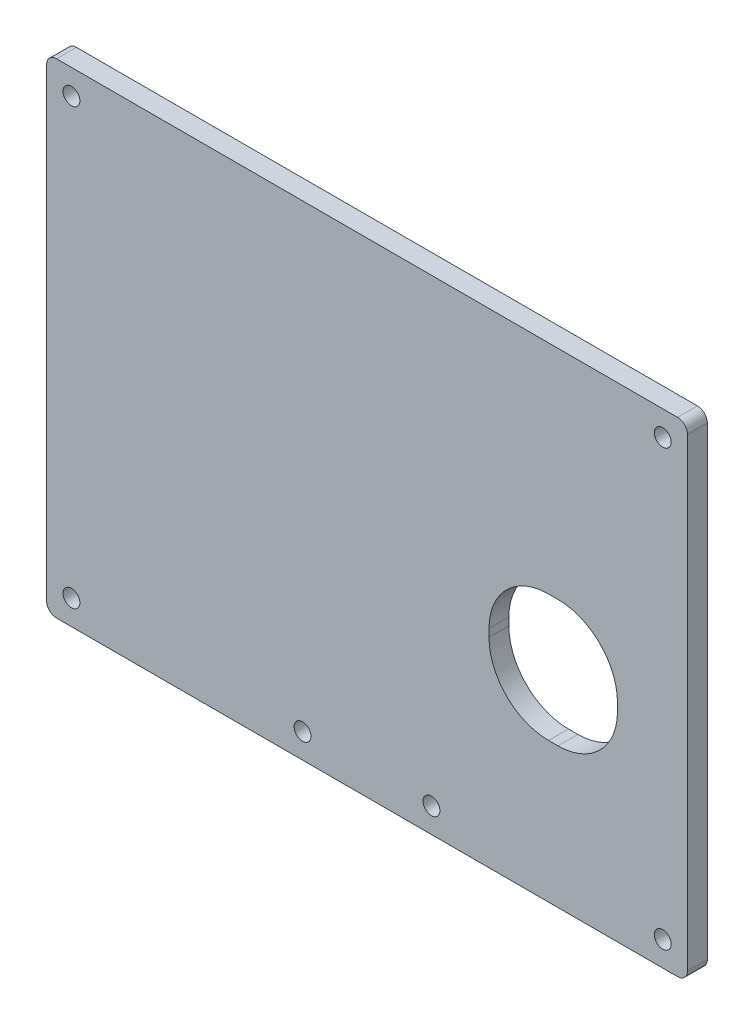
ISO-10303-21;
HEADER;
FILE_DESCRIPTION(('STEP AP214'),'2;1');
FILE_NAME('part.step','',(''),(''),'','','');
FILE_SCHEMA(('AUTOMOTIVE_DESIGN { 1 0 10303 214 1 1 1 1 }'));
ENDSEC;
DATA;
#1=APPLICATION_CONTEXT('core data for automotive mechanical design processes');
#2=APPLICATION_PROTOCOL_DEFINITION('international standard','automotive_design',2000,#1);
#3=PRODUCT_CONTEXT('',#1,'mechanical');
#4=PRODUCT('Part','Part','',(#3));
#5=PRODUCT_RELATED_PRODUCT_CATEGORY('part','',(#4));
#6=PRODUCT_DEFINITION_FORMATION('','',#4);
#7=PRODUCT_DEFINITION_CONTEXT('part definition',#1,'design');
#8=PRODUCT_DEFINITION('design','',#6,#7);
#9=PRODUCT_DEFINITION_SHAPE('','',#8);
#10=(LENGTH_UNIT() NAMED_UNIT(*) SI_UNIT(.MILLI.,.METRE.));
#11=(NAMED_UNIT(*) PLANE_ANGLE_UNIT() SI_UNIT($,.RADIAN.));
#12=(NAMED_UNIT(*) SI_UNIT($,.STERADIAN.) SOLID_ANGLE_UNIT());
#13=UNCERTAINTY_MEASURE_WITH_UNIT(LENGTH_MEASURE(1.E-05),#10,'distance_accuracy_value','');
#14=(GEOMETRIC_REPRESENTATION_CONTEXT(3) GLOBAL_UNCERTAINTY_ASSIGNED_CONTEXT((#13)) GLOBAL_UNIT_ASSIGNED_CONTEXT((#10,
#11,#12)) REPRESENTATION_CONTEXT('',''));
#15=CARTESIAN_POINT('',(0.,0.,0.));
#16=DIRECTION('',(0.,0.,1.));
#17=DIRECTION('',(1.,0.,0.));
#18=AXIS2_PLACEMENT_3D('',#15,#16,#17);
#19=CARTESIAN_POINT('',(6.58563613066051,33.7875307671692,4.));
#20=DIRECTION('',(0.,0.,-1.));
#21=DIRECTION('',(-1.,0.,0.));
#22=AXIS2_PLACEMENT_3D('',#19,#20,#21);
#23=CYLINDRICAL_SURFACE('',#22,2.);
#24=CARTESIAN_POINT('',(6.58563613066051,33.7875307671692,0.));
#25=DIRECTION('',(0.,0.,1.));
#26=DIRECTION('',(1.,0.,0.));
#27=AXIS2_PLACEMENT_3D('',#24,#25,#26);
#28=CIRCLE('',#27,2.);
#29=CARTESIAN_POINT('',(6.5856361306605,31.7875307671692,0.));
#30=VERTEX_POINT('',#29);
#31=CARTESIAN_POINT('',(8.58563613066051,33.7875307671692,0.));
#32=VERTEX_POINT('',#31);
#33=EDGE_CURVE('E172',#30,#32,#28,.T.);
#34=ORIENTED_EDGE('',*,*,#33,.T.);
#35=DIRECTION('',(0.,0.,-1.));
#36=VECTOR('',#35,1.);
#37=CARTESIAN_POINT('',(8.58563613066051,33.7875307671692,4.));
#38=LINE('',#37,#36);
#39=CARTESIAN_POINT('',(8.58563613066051,33.7875307671692,4.));
#40=VERTEX_POINT('',#39);
#41=EDGE_CURVE('E153',#40,#32,#38,.T.);
#42=ORIENTED_EDGE('',*,*,#41,.F.);
#43=CARTESIAN_POINT('',(6.58563613066051,33.7875307671692,4.));
#44=DIRECTION('',(0.,0.,1.));
#45=DIRECTION('',(1.,0.,0.));
#46=AXIS2_PLACEMENT_3D('',#43,#44,#45);
#47=CIRCLE('',#46,2.);
#48=CARTESIAN_POINT('',(6.5856361306605,31.7875307671692,4.));
#49=VERTEX_POINT('',#48);
#50=EDGE_CURVE('E160',#49,#40,#47,.T.);
#51=ORIENTED_EDGE('',*,*,#50,.F.);
#52=DIRECTION('',(0.,0.,-1.));
#53=VECTOR('',#52,1.);
#54=CARTESIAN_POINT('',(6.5856361306605,31.7875307671692,4.));
#55=LINE('',#54,#53);
#56=EDGE_CURVE('E266',#49,#30,#55,.T.);
#57=ORIENTED_EDGE('',*,*,#56,.T.);
#58=EDGE_LOOP('',(#34,#42,#51,#57));
#59=FACE_BOUND('',#58,.T.);
#60=ADVANCED_FACE('F35',(#59),#23,.T.);
#61=CARTESIAN_POINT('',(8.58563613066051,33.7875307671692,4.));
#62=DIRECTION('',(-1.,0.,0.));
#63=DIRECTION('',(0.,0.,1.));
#64=AXIS2_PLACEMENT_3D('',#61,#62,#63);
#65=PLANE('',#64);
#66=DIRECTION('',(0.,1.,0.));
#67=VECTOR('',#66,1.);
#68=CARTESIAN_POINT('',(8.58563613066051,33.7875307671692,0.));
#69=LINE('',#68,#67);
#70=CARTESIAN_POINT('',(8.58563613066051,127.407708230176,0.));
#71=VERTEX_POINT('',#70);
#72=EDGE_CURVE('E243',#32,#71,#69,.T.);
#73=ORIENTED_EDGE('',*,*,#72,.T.);
#74=DIRECTION('',(0.,0.,-1.));
#75=VECTOR('',#74,1.);
#76=CARTESIAN_POINT('',(8.58563613066051,127.407708230176,4.));
#77=LINE('',#76,#75);
#78=CARTESIAN_POINT('',(8.58563613066051,127.407708230176,4.));
#79=VERTEX_POINT('',#78);
#80=EDGE_CURVE('E156',#79,#71,#77,.T.);
#81=ORIENTED_EDGE('',*,*,#80,.F.);
#82=DIRECTION('',(0.,1.,0.));
#83=VECTOR('',#82,1.);
#84=CARTESIAN_POINT('',(8.58563613066051,33.7875307671692,4.));
#85=LINE('',#84,#83);
#86=EDGE_CURVE('E149',#40,#79,#85,.T.);
#87=ORIENTED_EDGE('',*,*,#86,.F.);
#88=ORIENTED_EDGE('',*,*,#41,.T.);
#89=EDGE_LOOP('',(#73,#81,#87,#88));
#90=FACE_BOUND('',#89,.T.);
#91=ADVANCED_FACE('F151',(#90),#65,.F.);
#92=CARTESIAN_POINT('',(6.58563613066051,127.407708230176,4.));
#93=DIRECTION('',(0.,0.,-1.));
#94=DIRECTION('',(-1.,0.,0.));
#95=AXIS2_PLACEMENT_3D('',#92,#93,#94);
#96=CYLINDRICAL_SURFACE('',#95,2.);
#97=CARTESIAN_POINT('',(6.58563613066051,127.407708230176,0.));
#98=DIRECTION('',(0.,0.,1.));
#99=DIRECTION('',(1.,0.,0.));
#100=AXIS2_PLACEMENT_3D('',#97,#98,#99);
#101=CIRCLE('',#100,2.);
#102=CARTESIAN_POINT('',(6.5856361306605,129.407708230176,0.));
#103=VERTEX_POINT('',#102);
#104=EDGE_CURVE('E247',#71,#103,#101,.T.);
#105=ORIENTED_EDGE('',*,*,#104,.T.);
#106=DIRECTION('',(0.,0.,-1.));
#107=VECTOR('',#106,1.);
#108=CARTESIAN_POINT('',(6.5856361306605,129.407708230176,4.));
#109=LINE('',#108,#107);
#110=CARTESIAN_POINT('',(6.5856361306605,129.407708230176,4.));
#111=VERTEX_POINT('',#110);
#112=EDGE_CURVE('E177',#111,#103,#109,.T.);
#113=ORIENTED_EDGE('',*,*,#112,.F.);
#114=CARTESIAN_POINT('',(6.58563613066051,127.407708230176,4.));
#115=DIRECTION('',(0.,0.,1.));
#116=DIRECTION('',(1.,0.,0.));
#117=AXIS2_PLACEMENT_3D('',#114,#115,#116);
#118=CIRCLE('',#117,2.);
#119=EDGE_CURVE('E159',#79,#111,#118,.T.);
#120=ORIENTED_EDGE('',*,*,#119,.F.);
#121=ORIENTED_EDGE('',*,*,#80,.T.);
#122=EDGE_LOOP('',(#105,#113,#120,#121));
#123=FACE_BOUND('',#122,.T.);
#124=ADVANCED_FACE('F310',(#123),#96,.T.);
#125=CARTESIAN_POINT('',(6.5856361306605,129.407708230176,4.));
#126=DIRECTION('',(0.,-1.,0.));
#127=DIRECTION('',(0.,0.,-1.));
#128=AXIS2_PLACEMENT_3D('',#125,#126,#127);
#129=PLANE('',#128);
#130=DIRECTION('',(-1.,0.,0.));
#131=VECTOR('',#130,1.);
#132=CARTESIAN_POINT('',(6.5856361306605,129.407708230176,0.));
#133=LINE('',#132,#131);
#134=CARTESIAN_POINT('',(-118.577385132025,129.407708230176,0.));
#135=VERTEX_POINT('',#134);
#136=EDGE_CURVE('E250',#103,#135,#133,.T.);
#137=ORIENTED_EDGE('',*,*,#136,.T.);
#138=DIRECTION('',(0.,0.,-1.));
#139=VECTOR('',#138,1.);
#140=CARTESIAN_POINT('',(-118.577385132025,129.407708230176,4.));
#141=LINE('',#140,#139);
#142=CARTESIAN_POINT('',(-118.577385132025,129.407708230176,4.));
#143=VERTEX_POINT('',#142);
#144=EDGE_CURVE('E277',#143,#135,#141,.T.);
#145=ORIENTED_EDGE('',*,*,#144,.F.);
#146=DIRECTION('',(-1.,0.,0.));
#147=VECTOR('',#146,1.);
#148=CARTESIAN_POINT('',(6.5856361306605,129.407708230176,4.));
#149=LINE('',#148,#147);
#150=EDGE_CURVE('E286',#111,#143,#149,.T.);
#151=ORIENTED_EDGE('',*,*,#150,.F.);
#152=ORIENTED_EDGE('',*,*,#112,.T.);
#153=EDGE_LOOP('',(#137,#145,#151,#152));
#154=FACE_BOUND('',#153,.T.);
#155=ADVANCED_FACE('F284',(#154),#129,.F.);
#156=CARTESIAN_POINT('',(-118.577385132025,127.407708230176,4.));
#157=DIRECTION('',(0.,0.,-1.));
#158=DIRECTION('',(-1.,0.,0.));
#159=AXIS2_PLACEMENT_3D('',#156,#157,#158);
#160=CYLINDRICAL_SURFACE('',#159,2.);
#161=CARTESIAN_POINT('',(-118.577385132025,127.407708230176,0.));
#162=DIRECTION('',(0.,0.,1.));
#163=DIRECTION('',(1.,0.,0.));
#164=AXIS2_PLACEMENT_3D('',#161,#162,#163);
#165=CIRCLE('',#164,2.);
#166=CARTESIAN_POINT('',(-120.577385132025,127.407708230176,0.));
#167=VERTEX_POINT('',#166);
#168=EDGE_CURVE('E257',#135,#167,#165,.T.);
#169=ORIENTED_EDGE('',*,*,#168,.T.);
#170=DIRECTION('',(0.,0.,-1.));
#171=VECTOR('',#170,1.);
#172=CARTESIAN_POINT('',(-120.577385132025,127.407708230176,4.));
#173=LINE('',#172,#171);
#174=CARTESIAN_POINT('',(-120.577385132025,127.407708230176,4.));
#175=VERTEX_POINT('',#174);
#176=EDGE_CURVE('E274',#175,#167,#173,.T.);
#177=ORIENTED_EDGE('',*,*,#176,.F.);
#178=CARTESIAN_POINT('',(-118.577385132025,127.407708230176,4.));
#179=DIRECTION('',(0.,0.,1.));
#180=DIRECTION('',(1.,0.,0.));
#181=AXIS2_PLACEMENT_3D('',#178,#179,#180);
#182=CIRCLE('',#181,2.);
#183=EDGE_CURVE('E305',#143,#175,#182,.T.);
#184=ORIENTED_EDGE('',*,*,#183,.F.);
#185=ORIENTED_EDGE('',*,*,#144,.T.);
#186=EDGE_LOOP('',(#169,#177,#184,#185));
#187=FACE_BOUND('',#186,.T.);
#188=ADVANCED_FACE('F296',(#187),#160,.T.);
#189=CARTESIAN_POINT('',(-120.577385132025,127.407708230176,4.));
#190=DIRECTION('',(1.,0.,0.));
#191=DIRECTION('',(0.,0.,-1.));
#192=AXIS2_PLACEMENT_3D('',#189,#190,#191);
#193=PLANE('',#192);
#194=DIRECTION('',(0.,-1.,0.));
#195=VECTOR('',#194,1.);
#196=CARTESIAN_POINT('',(-120.577385132025,127.407708230176,0.));
#197=LINE('',#196,#195);
#198=CARTESIAN_POINT('',(-120.577385132025,33.7875307671692,0.));
#199=VERTEX_POINT('',#198);
#200=EDGE_CURVE('E259',#167,#199,#197,.T.);
#201=ORIENTED_EDGE('',*,*,#200,.T.);
#202=DIRECTION('',(0.,0.,-1.));
#203=VECTOR('',#202,1.);
#204=CARTESIAN_POINT('',(-120.577385132025,33.7875307671692,4.));
#205=LINE('',#204,#203);
#206=CARTESIAN_POINT('',(-120.577385132025,33.7875307671692,4.));
#207=VERTEX_POINT('',#206);
#208=EDGE_CURVE('E271',#207,#199,#205,.T.);
#209=ORIENTED_EDGE('',*,*,#208,.F.);
#210=DIRECTION('',(0.,-1.,0.));
#211=VECTOR('',#210,1.);
#212=CARTESIAN_POINT('',(-120.577385132025,127.407708230176,4.));
#213=LINE('',#212,#211);
#214=EDGE_CURVE('E302',#175,#207,#213,.T.);
#215=ORIENTED_EDGE('',*,*,#214,.F.);
#216=ORIENTED_EDGE('',*,*,#176,.T.);
#217=EDGE_LOOP('',(#201,#209,#215,#216));
#218=FACE_BOUND('',#217,.T.);
#219=ADVANCED_FACE('F300',(#218),#193,.F.);
#220=CARTESIAN_POINT('',(-118.577385132025,33.7875307671692,4.));
#221=DIRECTION('',(0.,0.,-1.));
#222=DIRECTION('',(-1.,0.,0.));
#223=AXIS2_PLACEMENT_3D('',#220,#221,#222);
#224=CYLINDRICAL_SURFACE('',#223,2.);
#225=CARTESIAN_POINT('',(-118.577385132025,33.7875307671692,0.));
#226=DIRECTION('',(0.,0.,1.));
#227=DIRECTION('',(1.,0.,0.));
#228=AXIS2_PLACEMENT_3D('',#225,#226,#227);
#229=CIRCLE('',#228,2.);
#230=CARTESIAN_POINT('',(-118.577385132025,31.7875307671692,0.));
#231=VERTEX_POINT('',#230);
#232=EDGE_CURVE('E262',#199,#231,#229,.T.);
#233=ORIENTED_EDGE('',*,*,#232,.T.);
#234=DIRECTION('',(0.,0.,-1.));
#235=VECTOR('',#234,1.);
#236=CARTESIAN_POINT('',(-118.577385132025,31.7875307671692,4.));
#237=LINE('',#236,#235);
#238=CARTESIAN_POINT('',(-118.577385132025,31.7875307671692,4.));
#239=VERTEX_POINT('',#238);
#240=EDGE_CURVE('E268',#239,#231,#237,.T.);
#241=ORIENTED_EDGE('',*,*,#240,.F.);
#242=CARTESIAN_POINT('',(-118.577385132025,33.7875307671692,4.));
#243=DIRECTION('',(0.,0.,1.));
#244=DIRECTION('',(1.,0.,0.));
#245=AXIS2_PLACEMENT_3D('',#242,#243,#244);
#246=CIRCLE('',#245,2.);
#247=EDGE_CURVE('E304',#207,#239,#246,.T.);
#248=ORIENTED_EDGE('',*,*,#247,.F.);
#249=ORIENTED_EDGE('',*,*,#208,.T.);
#250=EDGE_LOOP('',(#233,#241,#248,#249));
#251=FACE_BOUND('',#250,.T.);
#252=ADVANCED_FACE('F462',(#251),#224,.T.);
#253=CARTESIAN_POINT('',(-118.577385132025,31.7875307671692,4.));
#254=DIRECTION('',(0.,1.,0.));
#255=DIRECTION('',(0.,0.,1.));
#256=AXIS2_PLACEMENT_3D('',#253,#254,#255);
#257=PLANE('',#256);
#258=DIRECTION('',(1.,0.,0.));
#259=VECTOR('',#258,1.);
#260=CARTESIAN_POINT('',(-118.577385132025,31.7875307671692,0.));
#261=LINE('',#260,#259);
#262=EDGE_CURVE('E169',#231,#30,#261,.T.);
#263=ORIENTED_EDGE('',*,*,#262,.T.);
#264=ORIENTED_EDGE('',*,*,#56,.F.);
#265=DIRECTION('',(1.,0.,0.));
#266=VECTOR('',#265,1.);
#267=CARTESIAN_POINT('',(-118.577385132025,31.7875307671692,4.));
#268=LINE('',#267,#266);
#269=EDGE_CURVE('E165',#239,#49,#268,.T.);
#270=ORIENTED_EDGE('',*,*,#269,.F.);
#271=ORIENTED_EDGE('',*,*,#240,.T.);
#272=EDGE_LOOP('',(#263,#264,#270,#271));
#273=FACE_BOUND('',#272,.T.);
#274=ADVANCED_FACE('F457',(#273),#257,.F.);
#275=CARTESIAN_POINT('',(6.58563613066051,33.7875307671692,4.));
#276=DIRECTION('',(0.,0.,1.));
#277=DIRECTION('',(1.,0.,0.));
#278=AXIS2_PLACEMENT_3D('',#275,#276,#277);
#279=PLANE('',#278);
#280=DIRECTION('',(0.,1.,0.));
#281=VECTOR('',#280,1.);
#282=CARTESIAN_POINT('',(-5.52621737536665,60.0149270728596,4.));
#283=LINE('',#282,#281);
#284=CARTESIAN_POINT('',(-5.52621737536665,72.0149270728596,4.));
#285=VERTEX_POINT('',#284);
#286=CARTESIAN_POINT('',(-5.52621737536665,73.5714407805882,4.));
#287=VERTEX_POINT('',#286);
#288=EDGE_CURVE('E402',#285,#287,#283,.T.);
#289=ORIENTED_EDGE('',*,*,#288,.F.);
#290=CARTESIAN_POINT('',(-17.5262173753667,72.0149270728596,4.));
#291=DIRECTION('',(0.,0.,1.));
#292=DIRECTION('',(1.,0.,0.));
#293=AXIS2_PLACEMENT_3D('',#290,#291,#292);
#294=CIRCLE('',#293,12.);
#295=CARTESIAN_POINT('',(-17.5262173753667,60.0149270728596,4.));
#296=VERTEX_POINT('',#295);
#297=EDGE_CURVE('E384',#285,#296,#294,.F.);
#298=ORIENTED_EDGE('',*,*,#297,.T.);
#299=DIRECTION('',(1.,0.,0.));
#300=VECTOR('',#299,1.);
#301=CARTESIAN_POINT('',(-5.52621737536665,60.0149270728596,4.));
#302=LINE('',#301,#300);
#303=CARTESIAN_POINT('',(-19.4193458135719,60.0149270728596,4.));
#304=VERTEX_POINT('',#303);
#305=EDGE_CURVE('E401',#304,#296,#302,.T.);
#306=ORIENTED_EDGE('',*,*,#305,.F.);
#307=CARTESIAN_POINT('',(-19.4193458135719,72.0149270728596,4.));
#308=DIRECTION('',(0.,0.,1.));
#309=DIRECTION('',(1.,0.,0.));
#310=AXIS2_PLACEMENT_3D('',#307,#308,#309);
#311=CIRCLE('',#310,12.);
#312=CARTESIAN_POINT('',(-31.4193458135719,72.0149270728596,4.));
#313=VERTEX_POINT('',#312);
#314=EDGE_CURVE('E346',#304,#313,#311,.F.);
#315=ORIENTED_EDGE('',*,*,#314,.T.);
#316=DIRECTION('',(0.,-1.,0.));
#317=VECTOR('',#316,1.);
#318=CARTESIAN_POINT('',(-31.4193458135719,60.0149270728596,4.));
#319=LINE('',#318,#317);
#320=CARTESIAN_POINT('',(-31.4193458135719,73.5714407805882,4.));
#321=VERTEX_POINT('',#320);
#322=EDGE_CURVE('E405',#321,#313,#319,.T.);
#323=ORIENTED_EDGE('',*,*,#322,.F.);
#324=CARTESIAN_POINT('',(-19.4193458135719,73.5714407805882,4.));
#325=DIRECTION('',(0.,0.,1.));
#326=DIRECTION('',(1.,0.,0.));
#327=AXIS2_PLACEMENT_3D('',#324,#325,#326);
#328=CIRCLE('',#327,12.);
#329=CARTESIAN_POINT('',(-19.4193458135719,85.5714407805882,4.));
#330=VERTEX_POINT('',#329);
#331=EDGE_CURVE('E44',#321,#330,#328,.F.);
#332=ORIENTED_EDGE('',*,*,#331,.T.);
#333=DIRECTION('',(-1.,0.,0.));
#334=VECTOR('',#333,1.);
#335=CARTESIAN_POINT('',(-5.52621737536665,85.5714407805882,4.));
#336=LINE('',#335,#334);
#337=CARTESIAN_POINT('',(-17.5262173753667,85.5714407805882,4.));
#338=VERTEX_POINT('',#337);
#339=EDGE_CURVE('E407',#338,#330,#336,.T.);
#340=ORIENTED_EDGE('',*,*,#339,.F.);
#341=CARTESIAN_POINT('',(-17.5262173753667,73.5714407805882,4.));
#342=DIRECTION('',(0.,0.,1.));
#343=DIRECTION('',(1.,0.,0.));
#344=AXIS2_PLACEMENT_3D('',#341,#342,#343);
#345=CIRCLE('',#344,12.);
#346=EDGE_CURVE('E380',#338,#287,#345,.F.);
#347=ORIENTED_EDGE('',*,*,#346,.T.);
#348=EDGE_LOOP('',(#289,#298,#306,#315,#323,#332,#340,#347));
#349=FACE_BOUND('',#348,.T.);
#350=CARTESIAN_POINT('',(-115.577385132025,124.407708230176,4.));
#351=DIRECTION('',(0.,0.,1.));
#352=DIRECTION('',(1.,0.,0.));
#353=AXIS2_PLACEMENT_3D('',#350,#351,#352);
#354=CIRCLE('',#353,1.69999999999999);
#355=CARTESIAN_POINT('',(-113.877385132025,124.407708230176,4.));
#356=VERTEX_POINT('',#355);
#357=EDGE_CURVE('E200',#356,#356,#354,.T.);
#358=ORIENTED_EDGE('',*,*,#357,.F.);
#359=EDGE_LOOP('',(#358));
#360=FACE_BOUND('',#359,.T.);
#361=CARTESIAN_POINT('',(3.58563613066052,124.407708230176,4.));
#362=DIRECTION('',(0.,0.,1.));
#363=DIRECTION('',(1.,0.,0.));
#364=AXIS2_PLACEMENT_3D('',#361,#362,#363);
#365=CIRCLE('',#364,1.7);
#366=CARTESIAN_POINT('',(5.28563613066052,124.407708230176,4.));
#367=VERTEX_POINT('',#366);
#368=EDGE_CURVE('E199',#367,#367,#365,.T.);
#369=ORIENTED_EDGE('',*,*,#368,.F.);
#370=EDGE_LOOP('',(#369));
#371=FACE_BOUND('',#370,.T.);
#372=CARTESIAN_POINT('',(-115.577385132025,36.7875307671692,4.));
#373=DIRECTION('',(0.,0.,1.));
#374=DIRECTION('',(1.,0.,0.));
#375=AXIS2_PLACEMENT_3D('',#372,#373,#374);
#376=CIRCLE('',#375,1.69999999999999);
#377=CARTESIAN_POINT('',(-113.877385132025,36.7875307671692,4.));
#378=VERTEX_POINT('',#377);
#379=EDGE_CURVE('E207',#378,#378,#376,.T.);
#380=ORIENTED_EDGE('',*,*,#379,.F.);
#381=EDGE_LOOP('',(#380));
#382=FACE_BOUND('',#381,.T.);
#383=CARTESIAN_POINT('',(-68.995874500682,36.7875307671692,4.));
#384=DIRECTION('',(0.,0.,1.));
#385=DIRECTION('',(1.,0.,0.));
#386=AXIS2_PLACEMENT_3D('',#383,#384,#385);
#387=CIRCLE('',#386,1.69999999999999);
#388=CARTESIAN_POINT('',(-67.295874500682,36.7875307671692,4.));
#389=VERTEX_POINT('',#388);
#390=EDGE_CURVE('E214',#389,#389,#387,.T.);
#391=ORIENTED_EDGE('',*,*,#390,.F.);
#392=EDGE_LOOP('',(#391));
#393=FACE_BOUND('',#392,.T.);
#394=CARTESIAN_POINT('',(-43.0152567571718,36.7875307671692,4.));
#395=DIRECTION('',(0.,0.,1.));
#396=DIRECTION('',(1.,0.,0.));
#397=AXIS2_PLACEMENT_3D('',#394,#395,#396);
#398=CIRCLE('',#397,1.7);
#399=CARTESIAN_POINT('',(-41.3152567571718,36.7875307671692,4.));
#400=VERTEX_POINT('',#399);
#401=EDGE_CURVE('E224',#400,#400,#398,.T.);
#402=ORIENTED_EDGE('',*,*,#401,.F.);
#403=EDGE_LOOP('',(#402));
#404=FACE_BOUND('',#403,.T.);
#405=CARTESIAN_POINT('',(3.58563613066053,36.7875307671692,4.));
#406=DIRECTION('',(0.,0.,1.));
#407=DIRECTION('',(1.,0.,0.));
#408=AXIS2_PLACEMENT_3D('',#405,#406,#407);
#409=CIRCLE('',#408,1.7);
#410=CARTESIAN_POINT('',(5.28563613066053,36.7875307671692,4.));
#411=VERTEX_POINT('',#410);
#412=EDGE_CURVE('E230',#411,#411,#409,.T.);
#413=ORIENTED_EDGE('',*,*,#412,.F.);
#414=EDGE_LOOP('',(#413));
#415=FACE_BOUND('',#414,.T.);
#416=ORIENTED_EDGE('',*,*,#50,.T.);
#417=ORIENTED_EDGE('',*,*,#86,.T.);
#418=ORIENTED_EDGE('',*,*,#119,.T.);
#419=ORIENTED_EDGE('',*,*,#150,.T.);
#420=ORIENTED_EDGE('',*,*,#183,.T.);
#421=ORIENTED_EDGE('',*,*,#214,.T.);
#422=ORIENTED_EDGE('',*,*,#247,.T.);
#423=ORIENTED_EDGE('',*,*,#269,.T.);
#424=EDGE_LOOP('',(#416,#417,#418,#419,#420,#421,#422,#423));
#425=FACE_BOUND('',#424,.T.);
#426=ADVANCED_FACE('F163',(#349,#360,#371,#382,#393,#404,#415,#425),#279,.T.);
#427=CARTESIAN_POINT('',(6.58563613066051,33.7875307671692,0.));
#428=DIRECTION('',(0.,0.,1.));
#429=DIRECTION('',(1.,0.,0.));
#430=AXIS2_PLACEMENT_3D('',#427,#428,#429);
#431=PLANE('',#430);
#432=DIRECTION('',(0.,-1.,0.));
#433=VECTOR('',#432,1.);
#434=CARTESIAN_POINT('',(-31.4193458135719,33.7875307671692,0.));
#435=LINE('',#434,#433);
#436=CARTESIAN_POINT('',(-31.4193458135719,73.5714407805882,0.));
#437=VERTEX_POINT('',#436);
#438=CARTESIAN_POINT('',(-31.4193458135719,72.0149270728596,0.));
#439=VERTEX_POINT('',#438);
#440=EDGE_CURVE('E175',#437,#439,#435,.T.);
#441=ORIENTED_EDGE('',*,*,#440,.T.);
#442=CARTESIAN_POINT('',(-19.4193458135719,72.0149270728596,0.));
#443=DIRECTION('',(0.,0.,1.));
#444=DIRECTION('',(1.,0.,0.));
#445=AXIS2_PLACEMENT_3D('',#442,#443,#444);
#446=CIRCLE('',#445,12.);
#447=CARTESIAN_POINT('',(-19.4193458135719,60.0149270728596,0.));
#448=VERTEX_POINT('',#447);
#449=EDGE_CURVE('E341',#439,#448,#446,.T.);
#450=ORIENTED_EDGE('',*,*,#449,.T.);
#451=DIRECTION('',(1.,0.,0.));
#452=VECTOR('',#451,1.);
#453=CARTESIAN_POINT('',(6.58563613066051,60.0149270728596,0.));
#454=LINE('',#453,#452);
#455=CARTESIAN_POINT('',(-17.5262173753667,60.0149270728596,0.));
#456=VERTEX_POINT('',#455);
#457=EDGE_CURVE('E356',#448,#456,#454,.T.);
#458=ORIENTED_EDGE('',*,*,#457,.T.);
#459=CARTESIAN_POINT('',(-17.5262173753667,72.0149270728596,0.));
#460=DIRECTION('',(0.,0.,1.));
#461=DIRECTION('',(1.,0.,0.));
#462=AXIS2_PLACEMENT_3D('',#459,#460,#461);
#463=CIRCLE('',#462,12.);
#464=CARTESIAN_POINT('',(-5.52621737536666,72.0149270728596,0.));
#465=VERTEX_POINT('',#464);
#466=EDGE_CURVE('E348',#456,#465,#463,.T.);
#467=ORIENTED_EDGE('',*,*,#466,.T.);
#468=DIRECTION('',(0.,1.,0.));
#469=VECTOR('',#468,1.);
#470=CARTESIAN_POINT('',(-5.52621737536666,33.7875307671692,0.));
#471=LINE('',#470,#469);
#472=CARTESIAN_POINT('',(-5.52621737536666,73.5714407805882,0.));
#473=VERTEX_POINT('',#472);
#474=EDGE_CURVE('E359',#465,#473,#471,.T.);
#475=ORIENTED_EDGE('',*,*,#474,.T.);
#476=CARTESIAN_POINT('',(-17.5262173753667,73.5714407805882,0.));
#477=DIRECTION('',(0.,0.,1.));
#478=DIRECTION('',(1.,0.,0.));
#479=AXIS2_PLACEMENT_3D('',#476,#477,#478);
#480=CIRCLE('',#479,12.);
#481=CARTESIAN_POINT('',(-17.5262173753667,85.5714407805882,0.));
#482=VERTEX_POINT('',#481);
#483=EDGE_CURVE('E381',#473,#482,#480,.T.);
#484=ORIENTED_EDGE('',*,*,#483,.T.);
#485=DIRECTION('',(-1.,0.,0.));
#486=VECTOR('',#485,1.);
#487=CARTESIAN_POINT('',(6.58563613066051,85.5714407805882,0.));
#488=LINE('',#487,#486);
#489=CARTESIAN_POINT('',(-19.4193458135719,85.5714407805882,0.));
#490=VERTEX_POINT('',#489);
#491=EDGE_CURVE('E173',#482,#490,#488,.T.);
#492=ORIENTED_EDGE('',*,*,#491,.T.);
#493=CARTESIAN_POINT('',(-19.4193458135719,73.5714407805882,0.));
#494=DIRECTION('',(0.,0.,1.));
#495=DIRECTION('',(1.,0.,0.));
#496=AXIS2_PLACEMENT_3D('',#493,#494,#495);
#497=CIRCLE('',#496,12.);
#498=EDGE_CURVE('E12',#490,#437,#497,.T.);
#499=ORIENTED_EDGE('',*,*,#498,.T.);
#500=EDGE_LOOP('',(#441,#450,#458,#467,#475,#484,#492,#499));
#501=FACE_BOUND('',#500,.T.);
#502=CARTESIAN_POINT('',(-115.577385132025,124.407708230176,0.));
#503=DIRECTION('',(0.,0.,1.));
#504=DIRECTION('',(1.,0.,0.));
#505=AXIS2_PLACEMENT_3D('',#502,#503,#504);
#506=CIRCLE('',#505,1.69999999999999);
#507=CARTESIAN_POINT('',(-113.877385132025,124.407708230176,0.));
#508=VERTEX_POINT('',#507);
#509=EDGE_CURVE('E194',#508,#508,#506,.T.);
#510=ORIENTED_EDGE('',*,*,#509,.T.);
#511=EDGE_LOOP('',(#510));
#512=FACE_BOUND('',#511,.T.);
#513=CARTESIAN_POINT('',(3.58563613066052,124.407708230176,0.));
#514=DIRECTION('',(0.,0.,1.));
#515=DIRECTION('',(1.,0.,0.));
#516=AXIS2_PLACEMENT_3D('',#513,#514,#515);
#517=CIRCLE('',#516,1.7);
#518=CARTESIAN_POINT('',(5.28563613066052,124.407708230176,0.));
#519=VERTEX_POINT('',#518);
#520=EDGE_CURVE('E203',#519,#519,#517,.T.);
#521=ORIENTED_EDGE('',*,*,#520,.T.);
#522=EDGE_LOOP('',(#521));
#523=FACE_BOUND('',#522,.T.);
#524=CARTESIAN_POINT('',(-115.577385132025,36.7875307671692,0.));
#525=DIRECTION('',(0.,0.,1.));
#526=DIRECTION('',(1.,0.,0.));
#527=AXIS2_PLACEMENT_3D('',#524,#525,#526);
#528=CIRCLE('',#527,1.69999999999999);
#529=CARTESIAN_POINT('',(-113.877385132025,36.7875307671692,0.));
#530=VERTEX_POINT('',#529);
#531=EDGE_CURVE('E210',#530,#530,#528,.T.);
#532=ORIENTED_EDGE('',*,*,#531,.T.);
#533=EDGE_LOOP('',(#532));
#534=FACE_BOUND('',#533,.T.);
#535=CARTESIAN_POINT('',(-68.995874500682,36.7875307671692,0.));
#536=DIRECTION('',(0.,0.,1.));
#537=DIRECTION('',(1.,0.,0.));
#538=AXIS2_PLACEMENT_3D('',#535,#536,#537);
#539=CIRCLE('',#538,1.69999999999999);
#540=CARTESIAN_POINT('',(-67.295874500682,36.7875307671692,0.));
#541=VERTEX_POINT('',#540);
#542=EDGE_CURVE('E220',#541,#541,#539,.T.);
#543=ORIENTED_EDGE('',*,*,#542,.T.);
#544=EDGE_LOOP('',(#543));
#545=FACE_BOUND('',#544,.T.);
#546=CARTESIAN_POINT('',(-43.0152567571718,36.7875307671692,0.));
#547=DIRECTION('',(0.,0.,1.));
#548=DIRECTION('',(1.,0.,0.));
#549=AXIS2_PLACEMENT_3D('',#546,#547,#548);
#550=CIRCLE('',#549,1.7);
#551=CARTESIAN_POINT('',(-41.3152567571718,36.7875307671692,0.));
#552=VERTEX_POINT('',#551);
#553=EDGE_CURVE('E226',#552,#552,#550,.T.);
#554=ORIENTED_EDGE('',*,*,#553,.T.);
#555=EDGE_LOOP('',(#554));
#556=FACE_BOUND('',#555,.T.);
#557=CARTESIAN_POINT('',(3.58563613066053,36.7875307671692,0.));
#558=DIRECTION('',(0.,0.,1.));
#559=DIRECTION('',(1.,0.,0.));
#560=AXIS2_PLACEMENT_3D('',#557,#558,#559);
#561=CIRCLE('',#560,1.7);
#562=CARTESIAN_POINT('',(5.28563613066053,36.7875307671692,0.));
#563=VERTEX_POINT('',#562);
#564=EDGE_CURVE('E233',#563,#563,#561,.T.);
#565=ORIENTED_EDGE('',*,*,#564,.T.);
#566=EDGE_LOOP('',(#565));
#567=FACE_BOUND('',#566,.T.);
#568=ORIENTED_EDGE('',*,*,#33,.F.);
#569=ORIENTED_EDGE('',*,*,#262,.F.);
#570=ORIENTED_EDGE('',*,*,#232,.F.);
#571=ORIENTED_EDGE('',*,*,#200,.F.);
#572=ORIENTED_EDGE('',*,*,#168,.F.);
#573=ORIENTED_EDGE('',*,*,#136,.F.);
#574=ORIENTED_EDGE('',*,*,#104,.F.);
#575=ORIENTED_EDGE('',*,*,#72,.F.);
#576=EDGE_LOOP('',(#568,#569,#570,#571,#572,#573,#574,#575));
#577=FACE_BOUND('',#576,.T.);
#578=ADVANCED_FACE('F291',(#501,#512,#523,#534,#545,#556,#567,#577),#431,.F.);
#579=CARTESIAN_POINT('',(3.58563613066053,36.7875307671692,4.));
#580=DIRECTION('',(0.,0.,1.));
#581=DIRECTION('',(1.,0.,0.));
#582=AXIS2_PLACEMENT_3D('',#579,#580,#581);
#583=CYLINDRICAL_SURFACE('',#582,1.7);
#584=ORIENTED_EDGE('',*,*,#564,.F.);
#585=EDGE_LOOP('',(#584));
#586=FACE_BOUND('',#585,.T.);
#587=ORIENTED_EDGE('',*,*,#412,.T.);
#588=EDGE_LOOP('',(#587));
#589=FACE_BOUND('',#588,.T.);
#590=ADVANCED_FACE('F450',(#586,#589),#583,.F.);
#591=CARTESIAN_POINT('',(-43.0152567571718,36.7875307671692,4.));
#592=DIRECTION('',(0.,0.,1.));
#593=DIRECTION('',(1.,0.,0.));
#594=AXIS2_PLACEMENT_3D('',#591,#592,#593);
#595=CYLINDRICAL_SURFACE('',#594,1.7);
#596=ORIENTED_EDGE('',*,*,#553,.F.);
#597=EDGE_LOOP('',(#596));
#598=FACE_BOUND('',#597,.T.);
#599=ORIENTED_EDGE('',*,*,#401,.T.);
#600=EDGE_LOOP('',(#599));
#601=FACE_BOUND('',#600,.T.);
#602=ADVANCED_FACE('F446',(#598,#601),#595,.F.);
#603=CARTESIAN_POINT('',(-68.995874500682,36.7875307671692,4.));
#604=DIRECTION('',(0.,0.,1.));
#605=DIRECTION('',(1.,0.,0.));
#606=AXIS2_PLACEMENT_3D('',#603,#604,#605);
#607=CYLINDRICAL_SURFACE('',#606,1.69999999999999);
#608=ORIENTED_EDGE('',*,*,#542,.F.);
#609=EDGE_LOOP('',(#608));
#610=FACE_BOUND('',#609,.T.);
#611=ORIENTED_EDGE('',*,*,#390,.T.);
#612=EDGE_LOOP('',(#611));
#613=FACE_BOUND('',#612,.T.);
#614=ADVANCED_FACE('F442',(#610,#613),#607,.F.);
#615=CARTESIAN_POINT('',(-115.577385132025,36.7875307671692,4.));
#616=DIRECTION('',(0.,0.,1.));
#617=DIRECTION('',(1.,0.,0.));
#618=AXIS2_PLACEMENT_3D('',#615,#616,#617);
#619=CYLINDRICAL_SURFACE('',#618,1.69999999999999);
#620=ORIENTED_EDGE('',*,*,#531,.F.);
#621=EDGE_LOOP('',(#620));
#622=FACE_BOUND('',#621,.T.);
#623=ORIENTED_EDGE('',*,*,#379,.T.);
#624=EDGE_LOOP('',(#623));
#625=FACE_BOUND('',#624,.T.);
#626=ADVANCED_FACE('F438',(#622,#625),#619,.F.);
#627=CARTESIAN_POINT('',(3.58563613066052,124.407708230176,4.));
#628=DIRECTION('',(0.,0.,1.));
#629=DIRECTION('',(1.,0.,0.));
#630=AXIS2_PLACEMENT_3D('',#627,#628,#629);
#631=CYLINDRICAL_SURFACE('',#630,1.7);
#632=ORIENTED_EDGE('',*,*,#520,.F.);
#633=EDGE_LOOP('',(#632));
#634=FACE_BOUND('',#633,.T.);
#635=ORIENTED_EDGE('',*,*,#368,.T.);
#636=EDGE_LOOP('',(#635));
#637=FACE_BOUND('',#636,.T.);
#638=ADVANCED_FACE('F434',(#634,#637),#631,.F.);
#639=CARTESIAN_POINT('',(-115.577385132025,124.407708230176,4.));
#640=DIRECTION('',(0.,0.,1.));
#641=DIRECTION('',(1.,0.,0.));
#642=AXIS2_PLACEMENT_3D('',#639,#640,#641);
#643=CYLINDRICAL_SURFACE('',#642,1.69999999999999);
#644=ORIENTED_EDGE('',*,*,#509,.F.);
#645=EDGE_LOOP('',(#644));
#646=FACE_BOUND('',#645,.T.);
#647=ORIENTED_EDGE('',*,*,#357,.T.);
#648=EDGE_LOOP('',(#647));
#649=FACE_BOUND('',#648,.T.);
#650=ADVANCED_FACE('F431',(#646,#649),#643,.F.);
#651=CARTESIAN_POINT('',(-5.52621737536665,60.0149270728596,-4.));
#652=DIRECTION('',(1.,0.,0.));
#653=DIRECTION('',(0.,0.,-1.));
#654=AXIS2_PLACEMENT_3D('',#651,#652,#653);
#655=PLANE('',#654);
#656=ORIENTED_EDGE('',*,*,#288,.T.);
#657=DIRECTION('',(0.,0.,1.));
#658=VECTOR('',#657,1.);
#659=CARTESIAN_POINT('',(-5.52621737536665,73.5714407805882,0.));
#660=LINE('',#659,#658);
#661=EDGE_CURVE('E371',#287,#473,#660,.F.);
#662=ORIENTED_EDGE('',*,*,#661,.T.);
#663=ORIENTED_EDGE('',*,*,#474,.F.);
#664=DIRECTION('',(0.,0.,1.));
#665=VECTOR('',#664,1.);
#666=CARTESIAN_POINT('',(-5.52621737536665,72.0149270728596,4.));
#667=LINE('',#666,#665);
#668=EDGE_CURVE('E368',#465,#285,#667,.T.);
#669=ORIENTED_EDGE('',*,*,#668,.T.);
#670=EDGE_LOOP('',(#656,#662,#663,#669));
#671=FACE_BOUND('',#670,.T.);
#672=ADVANCED_FACE('F394',(#671),#655,.F.);
#673=CARTESIAN_POINT('',(-5.52621737536665,60.0149270728596,-4.));
#674=DIRECTION('',(0.,-1.,0.));
#675=DIRECTION('',(0.,0.,-1.));
#676=AXIS2_PLACEMENT_3D('',#673,#674,#675);
#677=PLANE('',#676);
#678=ORIENTED_EDGE('',*,*,#305,.T.);
#679=DIRECTION('',(0.,0.,1.));
#680=VECTOR('',#679,1.);
#681=CARTESIAN_POINT('',(-17.5262173753667,60.0149270728596,0.));
#682=LINE('',#681,#680);
#683=EDGE_CURVE('E374',#296,#456,#682,.F.);
#684=ORIENTED_EDGE('',*,*,#683,.T.);
#685=ORIENTED_EDGE('',*,*,#457,.F.);
#686=DIRECTION('',(0.,0.,1.));
#687=VECTOR('',#686,1.);
#688=CARTESIAN_POINT('',(-19.4193458135719,60.0149270728596,4.));
#689=LINE('',#688,#687);
#690=EDGE_CURVE('E343',#448,#304,#689,.T.);
#691=ORIENTED_EDGE('',*,*,#690,.T.);
#692=EDGE_LOOP('',(#678,#684,#685,#691));
#693=FACE_BOUND('',#692,.T.);
#694=ADVANCED_FACE('F404',(#693),#677,.F.);
#695=CARTESIAN_POINT('',(-31.4193458135719,60.0149270728596,-4.));
#696=DIRECTION('',(-1.,0.,0.));
#697=DIRECTION('',(0.,0.,1.));
#698=AXIS2_PLACEMENT_3D('',#695,#696,#697);
#699=PLANE('',#698);
#700=ORIENTED_EDGE('',*,*,#322,.T.);
#701=DIRECTION('',(0.,0.,1.));
#702=VECTOR('',#701,1.);
#703=CARTESIAN_POINT('',(-31.4193458135719,72.0149270728596,0.));
#704=LINE('',#703,#702);
#705=EDGE_CURVE('E51',#313,#439,#704,.F.);
#706=ORIENTED_EDGE('',*,*,#705,.T.);
#707=ORIENTED_EDGE('',*,*,#440,.F.);
#708=DIRECTION('',(0.,0.,1.));
#709=VECTOR('',#708,1.);
#710=CARTESIAN_POINT('',(-31.4193458135719,73.5714407805882,4.));
#711=LINE('',#710,#709);
#712=EDGE_CURVE('E376',#437,#321,#711,.T.);
#713=ORIENTED_EDGE('',*,*,#712,.T.);
#714=EDGE_LOOP('',(#700,#706,#707,#713));
#715=FACE_BOUND('',#714,.T.);
#716=ADVANCED_FACE('F419',(#715),#699,.F.);
#717=CARTESIAN_POINT('',(-5.52621737536665,85.5714407805882,-4.));
#718=DIRECTION('',(0.,1.,0.));
#719=DIRECTION('',(0.,0.,1.));
#720=AXIS2_PLACEMENT_3D('',#717,#718,#719);
#721=PLANE('',#720);
#722=ORIENTED_EDGE('',*,*,#491,.F.);
#723=DIRECTION('',(0.,0.,1.));
#724=VECTOR('',#723,1.);
#725=CARTESIAN_POINT('',(-17.5262173753667,85.5714407805882,4.));
#726=LINE('',#725,#724);
#727=EDGE_CURVE('E365',#482,#338,#726,.T.);
#728=ORIENTED_EDGE('',*,*,#727,.T.);
#729=ORIENTED_EDGE('',*,*,#339,.T.);
#730=DIRECTION('',(0.,0.,1.));
#731=VECTOR('',#730,1.);
#732=CARTESIAN_POINT('',(-19.4193458135719,85.5714407805882,0.));
#733=LINE('',#732,#731);
#734=EDGE_CURVE('E363',#330,#490,#733,.F.);
#735=ORIENTED_EDGE('',*,*,#734,.T.);
#736=EDGE_LOOP('',(#722,#728,#729,#735));
#737=FACE_BOUND('',#736,.T.);
#738=ADVANCED_FACE('F328',(#737),#721,.F.);
#739=CARTESIAN_POINT('',(-17.5262173753667,73.5714407805882,-4.));
#740=DIRECTION('',(0.,0.,-1.));
#741=DIRECTION('',(-1.,0.,0.));
#742=AXIS2_PLACEMENT_3D('',#739,#740,#741);
#743=CYLINDRICAL_SURFACE('',#742,12.);
#744=ORIENTED_EDGE('',*,*,#483,.F.);
#745=ORIENTED_EDGE('',*,*,#661,.F.);
#746=ORIENTED_EDGE('',*,*,#346,.F.);
#747=ORIENTED_EDGE('',*,*,#727,.F.);
#748=EDGE_LOOP('',(#744,#745,#746,#747));
#749=FACE_BOUND('',#748,.T.);
#750=ADVANCED_FACE('F324',(#749),#743,.F.);
#751=CARTESIAN_POINT('',(-17.5262173753667,72.0149270728596,-4.));
#752=DIRECTION('',(0.,0.,-1.));
#753=DIRECTION('',(-1.,0.,0.));
#754=AXIS2_PLACEMENT_3D('',#751,#752,#753);
#755=CYLINDRICAL_SURFACE('',#754,12.);
#756=ORIENTED_EDGE('',*,*,#466,.F.);
#757=ORIENTED_EDGE('',*,*,#683,.F.);
#758=ORIENTED_EDGE('',*,*,#297,.F.);
#759=ORIENTED_EDGE('',*,*,#668,.F.);
#760=EDGE_LOOP('',(#756,#757,#758,#759));
#761=FACE_BOUND('',#760,.T.);
#762=ADVANCED_FACE('F327',(#761),#755,.F.);
#763=CARTESIAN_POINT('',(-19.4193458135719,72.0149270728596,-4.));
#764=DIRECTION('',(0.,0.,-1.));
#765=DIRECTION('',(-1.,0.,0.));
#766=AXIS2_PLACEMENT_3D('',#763,#764,#765);
#767=CYLINDRICAL_SURFACE('',#766,12.);
#768=ORIENTED_EDGE('',*,*,#449,.F.);
#769=ORIENTED_EDGE('',*,*,#705,.F.);
#770=ORIENTED_EDGE('',*,*,#314,.F.);
#771=ORIENTED_EDGE('',*,*,#690,.F.);
#772=EDGE_LOOP('',(#768,#769,#770,#771));
#773=FACE_BOUND('',#772,.T.);
#774=ADVANCED_FACE('F331',(#773),#767,.F.);
#775=CARTESIAN_POINT('',(-19.4193458135719,73.5714407805882,-4.));
#776=DIRECTION('',(0.,0.,-1.));
#777=DIRECTION('',(-1.,0.,0.));
#778=AXIS2_PLACEMENT_3D('',#775,#776,#777);
#779=CYLINDRICAL_SURFACE('',#778,12.);
#780=ORIENTED_EDGE('',*,*,#498,.F.);
#781=ORIENTED_EDGE('',*,*,#734,.F.);
#782=ORIENTED_EDGE('',*,*,#331,.F.);
#783=ORIENTED_EDGE('',*,*,#712,.F.);
#784=EDGE_LOOP('',(#780,#781,#782,#783));
#785=FACE_BOUND('',#784,.T.);
#786=ADVANCED_FACE('F37',(#785),#779,.F.);
#787=CLOSED_SHELL('',(#60,#91,#124,#155,#188,#219,#252,#274,#426,#578,#590,#602,#614,#626,#638,
#650,#672,#694,#716,#738,#750,#762,#774,#786));
#788=MANIFOLD_SOLID_BREP('B2',#787);
#789=ADVANCED_BREP_SHAPE_REPRESENTATION('',(#18,#788),#14);
#790=SHAPE_DEFINITION_REPRESENTATION(#9,#789);
ENDSEC;
END-ISO-10303-21;
